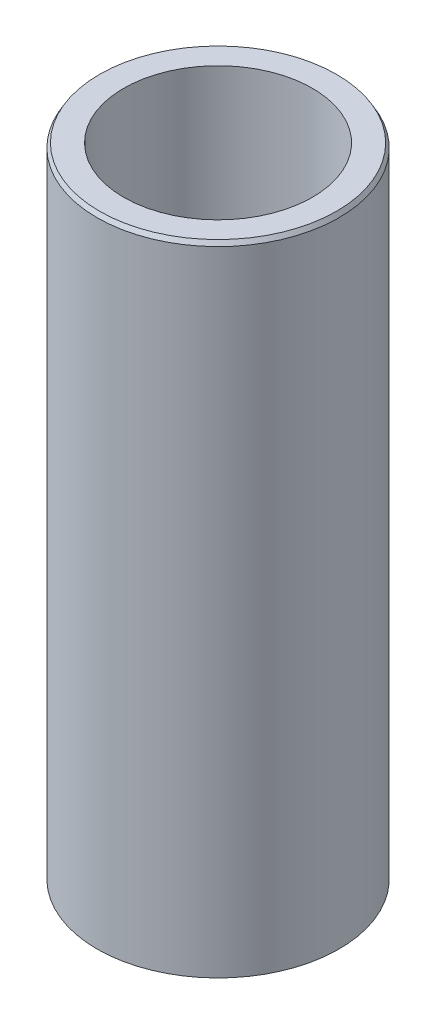
ISO-10303-21;
HEADER;
FILE_DESCRIPTION(('STEP AP214'),'2;1');
FILE_NAME('part.step','',(''),(''),'','','');
FILE_SCHEMA(('AUTOMOTIVE_DESIGN { 1 0 10303 214 1 1 1 1 }'));
ENDSEC;
DATA;
#1=APPLICATION_CONTEXT('core data for automotive mechanical design processes');
#2=APPLICATION_PROTOCOL_DEFINITION('international standard','automotive_design',2000,#1);
#3=PRODUCT_CONTEXT('',#1,'mechanical');
#4=PRODUCT('Part','Part','',(#3));
#5=PRODUCT_RELATED_PRODUCT_CATEGORY('part','',(#4));
#6=PRODUCT_DEFINITION_FORMATION('','',#4);
#7=PRODUCT_DEFINITION_CONTEXT('part definition',#1,'design');
#8=PRODUCT_DEFINITION('design','',#6,#7);
#9=PRODUCT_DEFINITION_SHAPE('','',#8);
#10=(LENGTH_UNIT() NAMED_UNIT(*) SI_UNIT(.MILLI.,.METRE.));
#11=(NAMED_UNIT(*) PLANE_ANGLE_UNIT() SI_UNIT($,.RADIAN.));
#12=(NAMED_UNIT(*) SI_UNIT($,.STERADIAN.) SOLID_ANGLE_UNIT());
#13=UNCERTAINTY_MEASURE_WITH_UNIT(LENGTH_MEASURE(1.E-05),#10,'distance_accuracy_value','');
#14=(GEOMETRIC_REPRESENTATION_CONTEXT(3) GLOBAL_UNCERTAINTY_ASSIGNED_CONTEXT((#13)) GLOBAL_UNIT_ASSIGNED_CONTEXT((#10,
#11,#12)) REPRESENTATION_CONTEXT('',''));
#15=CARTESIAN_POINT('',(0.,0.,0.));
#16=DIRECTION('',(0.,0.,1.));
#17=DIRECTION('',(1.,0.,0.));
#18=AXIS2_PLACEMENT_3D('',#15,#16,#17);
#19=CARTESIAN_POINT('',(0.,158.677275675681,0.));
#20=DIRECTION('',(0.,-1.,0.));
#21=DIRECTION('',(0.,0.,-1.));
#22=AXIS2_PLACEMENT_3D('',#19,#20,#21);
#23=CYLINDRICAL_SURFACE('',#22,30.);
#24=CARTESIAN_POINT('',(0.,157.602457859205,0.));
#25=DIRECTION('',(0.,1.,0.));
#26=DIRECTION('',(0.,0.,1.));
#27=AXIS2_PLACEMENT_3D('',#24,#25,#26);
#28=CIRCLE('',#27,30.);
#29=CARTESIAN_POINT('',(0.,157.602457859205,30.));
#30=VERTEX_POINT('',#29);
#31=EDGE_CURVE('E50',#30,#30,#28,.F.);
#32=ORIENTED_EDGE('',*,*,#31,.T.);
#33=EDGE_LOOP('',(#32));
#34=FACE_BOUND('',#33,.T.);
#35=CARTESIAN_POINT('',(0.,0.620546355672158,0.));
#36=DIRECTION('',(0.,1.,0.));
#37=DIRECTION('',(0.,0.,1.));
#38=AXIS2_PLACEMENT_3D('',#35,#36,#37);
#39=CIRCLE('',#38,30.);
#40=CARTESIAN_POINT('',(0.,0.620546355672158,30.));
#41=VERTEX_POINT('',#40);
#42=EDGE_CURVE('E51',#41,#41,#39,.T.);
#43=ORIENTED_EDGE('',*,*,#42,.T.);
#44=EDGE_LOOP('',(#43));
#45=FACE_BOUND('',#44,.T.);
#46=ADVANCED_FACE('F39',(#34,#45),#23,.T.);
#47=CARTESIAN_POINT('',(0.,158.677275675681,0.));
#48=DIRECTION('',(0.,1.,0.));
#49=DIRECTION('',(0.,0.,1.));
#50=AXIS2_PLACEMENT_3D('',#47,#48,#49);
#51=PLANE('',#50);
#52=CARTESIAN_POINT('',(0.,158.677275675681,0.));
#53=DIRECTION('',(0.,1.,0.));
#54=DIRECTION('',(0.,0.,1.));
#55=AXIS2_PLACEMENT_3D('',#52,#53,#54);
#56=CIRCLE('',#55,29.3794536443278);
#57=CARTESIAN_POINT('',(0.,158.677275675681,29.3794536443278));
#58=VERTEX_POINT('',#57);
#59=EDGE_CURVE('E54',#58,#58,#56,.T.);
#60=ORIENTED_EDGE('',*,*,#59,.T.);
#61=EDGE_LOOP('',(#60));
#62=FACE_BOUND('',#61,.T.);
#63=CARTESIAN_POINT('',(0.,158.677275675681,0.));
#64=DIRECTION('',(0.,1.,0.));
#65=DIRECTION('',(0.,0.,1.));
#66=AXIS2_PLACEMENT_3D('',#63,#64,#65);
#67=CIRCLE('',#66,23.4028507908773);
#68=CARTESIAN_POINT('',(0.,158.677275675681,23.4028507908773));
#69=VERTEX_POINT('',#68);
#70=EDGE_CURVE('E58',#69,#69,#67,.T.);
#71=ORIENTED_EDGE('',*,*,#70,.F.);
#72=EDGE_LOOP('',(#71));
#73=FACE_BOUND('',#72,.T.);
#74=ADVANCED_FACE('F69',(#62,#73),#51,.T.);
#75=CARTESIAN_POINT('',(0.,0.,0.));
#76=DIRECTION('',(0.,1.,0.));
#77=DIRECTION('',(0.,0.,1.));
#78=AXIS2_PLACEMENT_3D('',#75,#76,#77);
#79=PLANE('',#78);
#80=CARTESIAN_POINT('',(0.,0.,0.));
#81=DIRECTION('',(0.,1.,0.));
#82=DIRECTION('',(0.,0.,1.));
#83=AXIS2_PLACEMENT_3D('',#80,#81,#82);
#84=CIRCLE('',#83,28.9251821835241);
#85=CARTESIAN_POINT('',(0.,0.,28.9251821835241));
#86=VERTEX_POINT('',#85);
#87=EDGE_CURVE('E10',#86,#86,#84,.F.);
#88=ORIENTED_EDGE('',*,*,#87,.T.);
#89=EDGE_LOOP('',(#88));
#90=FACE_BOUND('',#89,.T.);
#91=CARTESIAN_POINT('',(0.,0.,0.));
#92=DIRECTION('',(0.,1.,0.));
#93=DIRECTION('',(0.,0.,1.));
#94=AXIS2_PLACEMENT_3D('',#91,#92,#93);
#95=CIRCLE('',#94,23.4028507908773);
#96=CARTESIAN_POINT('',(0.,0.,23.4028507908773));
#97=VERTEX_POINT('',#96);
#98=EDGE_CURVE('E63',#97,#97,#95,.T.);
#99=ORIENTED_EDGE('',*,*,#98,.T.);
#100=EDGE_LOOP('',(#99));
#101=FACE_BOUND('',#100,.T.);
#102=ADVANCED_FACE('F75',(#90,#101),#79,.F.);
#103=CARTESIAN_POINT('',(0.,158.677275675681,0.));
#104=DIRECTION('',(0.,-1.,0.));
#105=DIRECTION('',(0.,0.,-1.));
#106=AXIS2_PLACEMENT_3D('',#103,#104,#105);
#107=CYLINDRICAL_SURFACE('',#106,23.4028507908773);
#108=ORIENTED_EDGE('',*,*,#70,.T.);
#109=EDGE_LOOP('',(#108));
#110=FACE_BOUND('',#109,.T.);
#111=ORIENTED_EDGE('',*,*,#98,.F.);
#112=EDGE_LOOP('',(#111));
#113=FACE_BOUND('',#112,.T.);
#114=ADVANCED_FACE('F70',(#110,#113),#107,.F.);
#115=CARTESIAN_POINT('',(0.,158.677275675681,0.));
#116=DIRECTION('',(0.,-1.,0.));
#117=DIRECTION('',(0.,0.,-1.));
#118=AXIS2_PLACEMENT_3D('',#115,#116,#117);
#119=CONICAL_SURFACE('',#118,29.3794536443278,0.523598775598304);
#120=ORIENTED_EDGE('',*,*,#31,.F.);
#121=EDGE_LOOP('',(#120));
#122=FACE_BOUND('',#121,.T.);
#123=ORIENTED_EDGE('',*,*,#59,.F.);
#124=EDGE_LOOP('',(#123));
#125=FACE_BOUND('',#124,.T.);
#126=ADVANCED_FACE('F81',(#122,#125),#119,.T.);
#127=CARTESIAN_POINT('',(0.,0.620546355672158,0.));
#128=DIRECTION('',(0.,1.,0.));
#129=DIRECTION('',(0.,0.,1.));
#130=AXIS2_PLACEMENT_3D('',#127,#128,#129);
#131=CONICAL_SURFACE('',#130,30.,1.0471975511966);
#132=ORIENTED_EDGE('',*,*,#87,.F.);
#133=EDGE_LOOP('',(#132));
#134=FACE_BOUND('',#133,.T.);
#135=ORIENTED_EDGE('',*,*,#42,.F.);
#136=EDGE_LOOP('',(#135));
#137=FACE_BOUND('',#136,.T.);
#138=ADVANCED_FACE('F45',(#134,#137),#131,.T.);
#139=CLOSED_SHELL('',(#46,#74,#102,#114,#126,#138));
#140=MANIFOLD_SOLID_BREP('B2',#139);
#141=ADVANCED_BREP_SHAPE_REPRESENTATION('',(#18,#140),#14);
#142=SHAPE_DEFINITION_REPRESENTATION(#9,#141);
ENDSEC;
END-ISO-10303-21;
